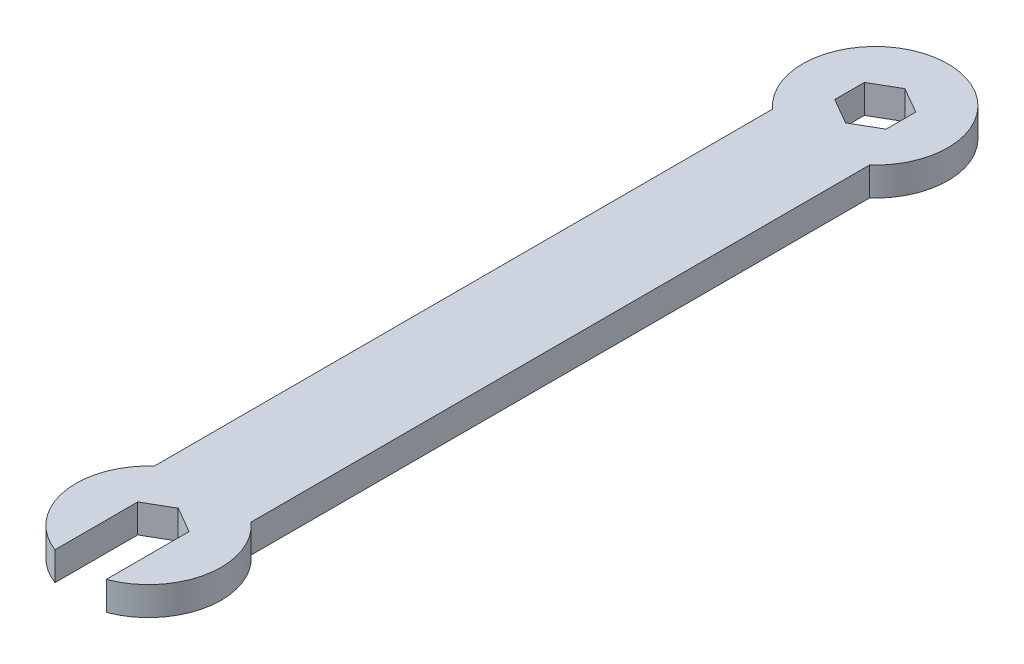
ISO-10303-21;
HEADER;
FILE_DESCRIPTION(('STEP AP214'),'2;1');
FILE_NAME('part.step','',(''),(''),'','','');
FILE_SCHEMA(('AUTOMOTIVE_DESIGN { 1 0 10303 214 1 1 1 1 }'));
ENDSEC;
DATA;
#1=APPLICATION_CONTEXT('core data for automotive mechanical design processes');
#2=APPLICATION_PROTOCOL_DEFINITION('international standard','automotive_design',2000,#1);
#3=PRODUCT_CONTEXT('',#1,'mechanical');
#4=PRODUCT('Part','Part','',(#3));
#5=PRODUCT_RELATED_PRODUCT_CATEGORY('part','',(#4));
#6=PRODUCT_DEFINITION_FORMATION('','',#4);
#7=PRODUCT_DEFINITION_CONTEXT('part definition',#1,'design');
#8=PRODUCT_DEFINITION('design','',#6,#7);
#9=PRODUCT_DEFINITION_SHAPE('','',#8);
#10=(LENGTH_UNIT() NAMED_UNIT(*) SI_UNIT(.MILLI.,.METRE.));
#11=(NAMED_UNIT(*) PLANE_ANGLE_UNIT() SI_UNIT($,.RADIAN.));
#12=(NAMED_UNIT(*) SI_UNIT($,.STERADIAN.) SOLID_ANGLE_UNIT());
#13=UNCERTAINTY_MEASURE_WITH_UNIT(LENGTH_MEASURE(1.E-05),#10,'distance_accuracy_value','');
#14=(GEOMETRIC_REPRESENTATION_CONTEXT(3) GLOBAL_UNCERTAINTY_ASSIGNED_CONTEXT((#13)) GLOBAL_UNIT_ASSIGNED_CONTEXT((#10,
#11,#12)) REPRESENTATION_CONTEXT('',''));
#15=CARTESIAN_POINT('',(0.,0.,0.));
#16=DIRECTION('',(0.,0.,1.));
#17=DIRECTION('',(1.,0.,0.));
#18=AXIS2_PLACEMENT_3D('',#15,#16,#17);
#19=CARTESIAN_POINT('',(1.325,2.95,-2.29496732002876));
#20=DIRECTION('',(-0.5,0.,0.866025403784439));
#21=DIRECTION('',(0.866025403784439,0.,0.5));
#22=AXIS2_PLACEMENT_3D('',#19,#20,#21);
#23=PLANE('',#22);
#24=DIRECTION('',(-0.866025403784439,0.,-0.5));
#25=VECTOR('',#24,1.);
#26=CARTESIAN_POINT('',(1.325,0.,-2.29496732002876));
#27=LINE('',#26,#25);
#28=CARTESIAN_POINT('',(2.65,0.,-1.52997821335251));
#29=VERTEX_POINT('',#28);
#30=CARTESIAN_POINT('',(0.,0.,-3.05995642670502));
#31=VERTEX_POINT('',#30);
#32=EDGE_CURVE('E205',#29,#31,#27,.T.);
#33=ORIENTED_EDGE('',*,*,#32,.F.);
#34=DIRECTION('',(0.,-1.,0.));
#35=VECTOR('',#34,1.);
#36=CARTESIAN_POINT('',(2.65,2.95,-1.52997821335251));
#37=LINE('',#36,#35);
#38=CARTESIAN_POINT('',(2.65,2.95,-1.52997821335251));
#39=VERTEX_POINT('',#38);
#40=EDGE_CURVE('E11',#39,#29,#37,.T.);
#41=ORIENTED_EDGE('',*,*,#40,.F.);
#42=DIRECTION('',(-0.866025403784439,0.,-0.5));
#43=VECTOR('',#42,1.);
#44=CARTESIAN_POINT('',(1.325,2.95,-2.29496732002876));
#45=LINE('',#44,#43);
#46=CARTESIAN_POINT('',(0.,2.95,-3.05995642670502));
#47=VERTEX_POINT('',#46);
#48=EDGE_CURVE('E457',#39,#47,#45,.T.);
#49=ORIENTED_EDGE('',*,*,#48,.T.);
#50=DIRECTION('',(0.,-1.,0.));
#51=VECTOR('',#50,1.);
#52=CARTESIAN_POINT('',(0.,2.95,-3.05995642670502));
#53=LINE('',#52,#51);
#54=EDGE_CURVE('E54',#47,#31,#53,.T.);
#55=ORIENTED_EDGE('',*,*,#54,.T.);
#56=EDGE_LOOP('',(#33,#41,#49,#55));
#57=FACE_BOUND('',#56,.T.);
#58=ADVANCED_FACE('F35',(#57),#23,.T.);
#59=CARTESIAN_POINT('',(2.65,2.95,0.));
#60=DIRECTION('',(-1.,0.,0.));
#61=DIRECTION('',(0.,0.,1.));
#62=AXIS2_PLACEMENT_3D('',#59,#60,#61);
#63=PLANE('',#62);
#64=DIRECTION('',(0.,0.,-1.));
#65=VECTOR('',#64,1.);
#66=CARTESIAN_POINT('',(2.65,0.,0.));
#67=LINE('',#66,#65);
#68=CARTESIAN_POINT('',(2.65,0.,1.52997821335251));
#69=VERTEX_POINT('',#68);
#70=EDGE_CURVE('E207',#69,#29,#67,.T.);
#71=ORIENTED_EDGE('',*,*,#70,.F.);
#72=DIRECTION('',(0.,-1.,0.));
#73=VECTOR('',#72,1.);
#74=CARTESIAN_POINT('',(2.65,2.95,1.52997821335251));
#75=LINE('',#74,#73);
#76=CARTESIAN_POINT('',(2.65,2.95,1.52997821335251));
#77=VERTEX_POINT('',#76);
#78=EDGE_CURVE('E45',#77,#69,#75,.T.);
#79=ORIENTED_EDGE('',*,*,#78,.F.);
#80=DIRECTION('',(0.,0.,-1.));
#81=VECTOR('',#80,1.);
#82=CARTESIAN_POINT('',(2.65,2.95,0.));
#83=LINE('',#82,#81);
#84=EDGE_CURVE('E459',#77,#39,#83,.T.);
#85=ORIENTED_EDGE('',*,*,#84,.T.);
#86=ORIENTED_EDGE('',*,*,#40,.T.);
#87=EDGE_LOOP('',(#71,#79,#85,#86));
#88=FACE_BOUND('',#87,.T.);
#89=ADVANCED_FACE('F293',(#88),#63,.T.);
#90=CARTESIAN_POINT('',(1.325,2.95,2.29496732002876));
#91=DIRECTION('',(-0.5,0.,-0.866025403784438));
#92=DIRECTION('',(-0.866025403784439,0.,0.5));
#93=AXIS2_PLACEMENT_3D('',#90,#91,#92);
#94=PLANE('',#93);
#95=DIRECTION('',(0.866025403784439,0.,-0.5));
#96=VECTOR('',#95,1.);
#97=CARTESIAN_POINT('',(1.325,0.,2.29496732002876));
#98=LINE('',#97,#96);
#99=CARTESIAN_POINT('',(0.,0.,3.05995642670502));
#100=VERTEX_POINT('',#99);
#101=EDGE_CURVE('E210',#100,#69,#98,.T.);
#102=ORIENTED_EDGE('',*,*,#101,.F.);
#103=DIRECTION('',(0.,-1.,0.));
#104=VECTOR('',#103,1.);
#105=CARTESIAN_POINT('',(0.,2.95,3.05995642670502));
#106=LINE('',#105,#104);
#107=CARTESIAN_POINT('',(0.,2.95,3.05995642670502));
#108=VERTEX_POINT('',#107);
#109=EDGE_CURVE('E159',#108,#100,#106,.T.);
#110=ORIENTED_EDGE('',*,*,#109,.F.);
#111=DIRECTION('',(0.866025403784439,0.,-0.5));
#112=VECTOR('',#111,1.);
#113=CARTESIAN_POINT('',(1.325,2.95,2.29496732002876));
#114=LINE('',#113,#112);
#115=EDGE_CURVE('E170',#108,#77,#114,.T.);
#116=ORIENTED_EDGE('',*,*,#115,.T.);
#117=ORIENTED_EDGE('',*,*,#78,.T.);
#118=EDGE_LOOP('',(#102,#110,#116,#117));
#119=FACE_BOUND('',#118,.T.);
#120=ADVANCED_FACE('F298',(#119),#94,.T.);
#121=CARTESIAN_POINT('',(-1.325,2.95,2.29496732002876));
#122=DIRECTION('',(0.5,0.,-0.866025403784438));
#123=DIRECTION('',(-0.866025403784439,0.,-0.5));
#124=AXIS2_PLACEMENT_3D('',#121,#122,#123);
#125=PLANE('',#124);
#126=DIRECTION('',(0.866025403784439,0.,0.5));
#127=VECTOR('',#126,1.);
#128=CARTESIAN_POINT('',(-1.325,0.,2.29496732002876));
#129=LINE('',#128,#127);
#130=CARTESIAN_POINT('',(-2.65,0.,1.52997821335251));
#131=VERTEX_POINT('',#130);
#132=EDGE_CURVE('E155',#131,#100,#129,.T.);
#133=ORIENTED_EDGE('',*,*,#132,.F.);
#134=DIRECTION('',(0.,-1.,0.));
#135=VECTOR('',#134,1.);
#136=CARTESIAN_POINT('',(-2.65,2.95,1.52997821335251));
#137=LINE('',#136,#135);
#138=CARTESIAN_POINT('',(-2.65,2.95,1.52997821335251));
#139=VERTEX_POINT('',#138);
#140=EDGE_CURVE('E150',#139,#131,#137,.T.);
#141=ORIENTED_EDGE('',*,*,#140,.F.);
#142=DIRECTION('',(0.866025403784439,0.,0.5));
#143=VECTOR('',#142,1.);
#144=CARTESIAN_POINT('',(-1.325,2.95,2.29496732002876));
#145=LINE('',#144,#143);
#146=EDGE_CURVE('E153',#139,#108,#145,.T.);
#147=ORIENTED_EDGE('',*,*,#146,.T.);
#148=ORIENTED_EDGE('',*,*,#109,.T.);
#149=EDGE_LOOP('',(#133,#141,#147,#148));
#150=FACE_BOUND('',#149,.T.);
#151=ADVANCED_FACE('F152',(#150),#125,.T.);
#152=CARTESIAN_POINT('',(-2.65,2.95,0.));
#153=DIRECTION('',(1.,0.,0.));
#154=DIRECTION('',(0.,0.,-1.));
#155=AXIS2_PLACEMENT_3D('',#152,#153,#154);
#156=PLANE('',#155);
#157=DIRECTION('',(0.,0.,1.));
#158=VECTOR('',#157,1.);
#159=CARTESIAN_POINT('',(-2.65,0.,0.));
#160=LINE('',#159,#158);
#161=CARTESIAN_POINT('',(-2.65,0.,-1.52997821335251));
#162=VERTEX_POINT('',#161);
#163=EDGE_CURVE('E214',#162,#131,#160,.T.);
#164=ORIENTED_EDGE('',*,*,#163,.F.);
#165=DIRECTION('',(0.,-1.,0.));
#166=VECTOR('',#165,1.);
#167=CARTESIAN_POINT('',(-2.65,2.95,-1.52997821335251));
#168=LINE('',#167,#166);
#169=CARTESIAN_POINT('',(-2.65,2.95,-1.52997821335251));
#170=VERTEX_POINT('',#169);
#171=EDGE_CURVE('E100',#170,#162,#168,.T.);
#172=ORIENTED_EDGE('',*,*,#171,.F.);
#173=DIRECTION('',(0.,0.,1.));
#174=VECTOR('',#173,1.);
#175=CARTESIAN_POINT('',(-2.65,2.95,0.));
#176=LINE('',#175,#174);
#177=EDGE_CURVE('E167',#170,#139,#176,.T.);
#178=ORIENTED_EDGE('',*,*,#177,.T.);
#179=ORIENTED_EDGE('',*,*,#140,.T.);
#180=EDGE_LOOP('',(#164,#172,#178,#179));
#181=FACE_BOUND('',#180,.T.);
#182=ADVANCED_FACE('F172',(#181),#156,.T.);
#183=CARTESIAN_POINT('',(0.,2.95,0.));
#184=DIRECTION('',(0.,-1.,0.));
#185=DIRECTION('',(0.,0.,-1.));
#186=AXIS2_PLACEMENT_3D('',#183,#184,#185);
#187=CYLINDRICAL_SURFACE('',#186,7.5);
#188=CARTESIAN_POINT('',(0.,0.,0.));
#189=DIRECTION('',(0.,1.,0.));
#190=DIRECTION('',(0.,0.,1.));
#191=AXIS2_PLACEMENT_3D('',#188,#189,#190);
#192=CIRCLE('',#191,7.5);
#193=CARTESIAN_POINT('',(5.,0.,5.59016994374947));
#194=VERTEX_POINT('',#193);
#195=CARTESIAN_POINT('',(-5.,0.,5.59016994374947));
#196=VERTEX_POINT('',#195);
#197=EDGE_CURVE('E179',#194,#196,#192,.T.);
#198=ORIENTED_EDGE('',*,*,#197,.T.);
#199=DIRECTION('',(0.,-1.,0.));
#200=VECTOR('',#199,1.);
#201=CARTESIAN_POINT('',(-5.,2.95,5.59016994374947));
#202=LINE('',#201,#200);
#203=CARTESIAN_POINT('',(-5.,2.95,5.59016994374947));
#204=VERTEX_POINT('',#203);
#205=EDGE_CURVE('E39',#204,#196,#202,.T.);
#206=ORIENTED_EDGE('',*,*,#205,.F.);
#207=CARTESIAN_POINT('',(0.,2.95,0.));
#208=DIRECTION('',(0.,1.,0.));
#209=DIRECTION('',(0.,0.,1.));
#210=AXIS2_PLACEMENT_3D('',#207,#208,#209);
#211=CIRCLE('',#210,7.5);
#212=CARTESIAN_POINT('',(5.,2.95,5.59016994374947));
#213=VERTEX_POINT('',#212);
#214=EDGE_CURVE('E219',#213,#204,#211,.T.);
#215=ORIENTED_EDGE('',*,*,#214,.F.);
#216=DIRECTION('',(0.,-1.,0.));
#217=VECTOR('',#216,1.);
#218=CARTESIAN_POINT('',(5.,2.95,5.59016994374947));
#219=LINE('',#218,#217);
#220=EDGE_CURVE('E175',#213,#194,#219,.T.);
#221=ORIENTED_EDGE('',*,*,#220,.T.);
#222=EDGE_LOOP('',(#198,#206,#215,#221));
#223=FACE_BOUND('',#222,.T.);
#224=ADVANCED_FACE('F37',(#223),#187,.T.);
#225=CARTESIAN_POINT('',(-5.,2.95,0.));
#226=DIRECTION('',(1.,0.,0.));
#227=DIRECTION('',(0.,0.,-1.));
#228=AXIS2_PLACEMENT_3D('',#225,#226,#227);
#229=PLANE('',#228);
#230=DIRECTION('',(0.,0.,1.));
#231=VECTOR('',#230,1.);
#232=CARTESIAN_POINT('',(-5.,0.,0.));
#233=LINE('',#232,#231);
#234=CARTESIAN_POINT('',(-5.00000000000001,0.,69.4098300562505));
#235=VERTEX_POINT('',#234);
#236=EDGE_CURVE('E182',#196,#235,#233,.T.);
#237=ORIENTED_EDGE('',*,*,#236,.T.);
#238=DIRECTION('',(0.,-1.,0.));
#239=VECTOR('',#238,1.);
#240=CARTESIAN_POINT('',(-5.00000000000001,2.95,69.4098300562505));
#241=LINE('',#240,#239);
#242=CARTESIAN_POINT('',(-5.00000000000001,2.95,69.4098300562505));
#243=VERTEX_POINT('',#242);
#244=EDGE_CURVE('E236',#243,#235,#241,.T.);
#245=ORIENTED_EDGE('',*,*,#244,.F.);
#246=DIRECTION('',(0.,0.,1.));
#247=VECTOR('',#246,1.);
#248=CARTESIAN_POINT('',(-5.,2.95,0.));
#249=LINE('',#248,#247);
#250=EDGE_CURVE('E113',#204,#243,#249,.T.);
#251=ORIENTED_EDGE('',*,*,#250,.F.);
#252=ORIENTED_EDGE('',*,*,#205,.T.);
#253=EDGE_LOOP('',(#237,#245,#251,#252));
#254=FACE_BOUND('',#253,.T.);
#255=ADVANCED_FACE('F242',(#254),#229,.F.);
#256=CARTESIAN_POINT('',(0.,2.95,75.));
#257=DIRECTION('',(0.,-1.,0.));
#258=DIRECTION('',(0.,0.,-1.));
#259=AXIS2_PLACEMENT_3D('',#256,#257,#258);
#260=CYLINDRICAL_SURFACE('',#259,7.5);
#261=CARTESIAN_POINT('',(0.,0.,75.));
#262=DIRECTION('',(0.,1.,0.));
#263=DIRECTION('',(0.,0.,1.));
#264=AXIS2_PLACEMENT_3D('',#261,#262,#263);
#265=CIRCLE('',#264,7.5);
#266=CARTESIAN_POINT('',(-2.65,0.,82.0162311820521));
#267=VERTEX_POINT('',#266);
#268=EDGE_CURVE('E184',#235,#267,#265,.T.);
#269=ORIENTED_EDGE('',*,*,#268,.T.);
#270=DIRECTION('',(0.,-1.,0.));
#271=VECTOR('',#270,1.);
#272=CARTESIAN_POINT('',(-2.65,2.95,82.0162311820521));
#273=LINE('',#272,#271);
#274=CARTESIAN_POINT('',(-2.65,2.95,82.0162311820521));
#275=VERTEX_POINT('',#274);
#276=EDGE_CURVE('E235',#275,#267,#273,.T.);
#277=ORIENTED_EDGE('',*,*,#276,.F.);
#278=CARTESIAN_POINT('',(0.,2.95,75.));
#279=DIRECTION('',(0.,1.,0.));
#280=DIRECTION('',(0.,0.,1.));
#281=AXIS2_PLACEMENT_3D('',#278,#279,#280);
#282=CIRCLE('',#281,7.5);
#283=EDGE_CURVE('E471',#243,#275,#282,.T.);
#284=ORIENTED_EDGE('',*,*,#283,.F.);
#285=ORIENTED_EDGE('',*,*,#244,.T.);
#286=EDGE_LOOP('',(#269,#277,#284,#285));
#287=FACE_BOUND('',#286,.T.);
#288=ADVANCED_FACE('F284',(#287),#260,.T.);
#289=CARTESIAN_POINT('',(-2.65,2.95,0.));
#290=DIRECTION('',(1.,0.,0.));
#291=DIRECTION('',(0.,0.,-1.));
#292=AXIS2_PLACEMENT_3D('',#289,#290,#291);
#293=PLANE('',#292);
#294=DIRECTION('',(0.,0.,1.));
#295=VECTOR('',#294,1.);
#296=CARTESIAN_POINT('',(-2.65,0.,0.));
#297=LINE('',#296,#295);
#298=CARTESIAN_POINT('',(-2.65,0.,73.4700217866475));
#299=VERTEX_POINT('',#298);
#300=EDGE_CURVE('E187',#299,#267,#297,.T.);
#301=ORIENTED_EDGE('',*,*,#300,.F.);
#302=DIRECTION('',(0.,-1.,0.));
#303=VECTOR('',#302,1.);
#304=CARTESIAN_POINT('',(-2.65,2.95,73.4700217866475));
#305=LINE('',#304,#303);
#306=CARTESIAN_POINT('',(-2.65,2.95,73.4700217866475));
#307=VERTEX_POINT('',#306);
#308=EDGE_CURVE('E233',#307,#299,#305,.T.);
#309=ORIENTED_EDGE('',*,*,#308,.F.);
#310=DIRECTION('',(0.,0.,1.));
#311=VECTOR('',#310,1.);
#312=CARTESIAN_POINT('',(-2.65,2.95,0.));
#313=LINE('',#312,#311);
#314=EDGE_CURVE('E283',#307,#275,#313,.T.);
#315=ORIENTED_EDGE('',*,*,#314,.T.);
#316=ORIENTED_EDGE('',*,*,#276,.T.);
#317=EDGE_LOOP('',(#301,#309,#315,#316));
#318=FACE_BOUND('',#317,.T.);
#319=ADVANCED_FACE('F281',(#318),#293,.T.);
#320=CARTESIAN_POINT('',(31.1509526419164,2.95,53.9550326799712));
#321=DIRECTION('',(0.5,0.,0.866025403784439));
#322=DIRECTION('',(0.866025403784439,0.,-0.5));
#323=AXIS2_PLACEMENT_3D('',#320,#321,#322);
#324=PLANE('',#323);
#325=DIRECTION('',(-0.866025403784439,0.,0.5));
#326=VECTOR('',#325,1.);
#327=CARTESIAN_POINT('',(31.1509526419164,0.,53.9550326799712));
#328=LINE('',#327,#326);
#329=CARTESIAN_POINT('',(0.,0.,71.940043573295));
#330=VERTEX_POINT('',#329);
#331=EDGE_CURVE('E190',#330,#299,#328,.T.);
#332=ORIENTED_EDGE('',*,*,#331,.F.);
#333=DIRECTION('',(0.,-1.,0.));
#334=VECTOR('',#333,1.);
#335=CARTESIAN_POINT('',(0.,2.95,71.940043573295));
#336=LINE('',#335,#334);
#337=CARTESIAN_POINT('',(0.,2.95,71.940043573295));
#338=VERTEX_POINT('',#337);
#339=EDGE_CURVE('E231',#338,#330,#336,.T.);
#340=ORIENTED_EDGE('',*,*,#339,.F.);
#341=DIRECTION('',(-0.866025403784439,0.,0.5));
#342=VECTOR('',#341,1.);
#343=CARTESIAN_POINT('',(31.1509526419164,2.95,53.9550326799712));
#344=LINE('',#343,#342);
#345=EDGE_CURVE('E277',#338,#307,#344,.T.);
#346=ORIENTED_EDGE('',*,*,#345,.T.);
#347=ORIENTED_EDGE('',*,*,#308,.T.);
#348=EDGE_LOOP('',(#332,#340,#346,#347));
#349=FACE_BOUND('',#348,.T.);
#350=ADVANCED_FACE('F274',(#349),#324,.T.);
#351=CARTESIAN_POINT('',(-31.1509526419166,2.95,53.955032679971));
#352=DIRECTION('',(-0.500000000000003,0.,0.866025403784437));
#353=DIRECTION('',(0.866025403784437,0.,0.500000000000003));
#354=AXIS2_PLACEMENT_3D('',#351,#352,#353);
#355=PLANE('',#354);
#356=DIRECTION('',(-0.866025403784437,0.,-0.500000000000003));
#357=VECTOR('',#356,1.);
#358=CARTESIAN_POINT('',(-31.1509526419166,0.,53.955032679971));
#359=LINE('',#358,#357);
#360=CARTESIAN_POINT('',(2.64999999999999,0.,73.4700217866475));
#361=VERTEX_POINT('',#360);
#362=EDGE_CURVE('E193',#361,#330,#359,.T.);
#363=ORIENTED_EDGE('',*,*,#362,.F.);
#364=DIRECTION('',(0.,-1.,0.));
#365=VECTOR('',#364,1.);
#366=CARTESIAN_POINT('',(2.64999999999999,2.95,73.4700217866475));
#367=LINE('',#366,#365);
#368=CARTESIAN_POINT('',(2.64999999999999,2.95,73.4700217866475));
#369=VERTEX_POINT('',#368);
#370=EDGE_CURVE('E229',#369,#361,#367,.T.);
#371=ORIENTED_EDGE('',*,*,#370,.F.);
#372=DIRECTION('',(-0.866025403784437,0.,-0.500000000000003));
#373=VECTOR('',#372,1.);
#374=CARTESIAN_POINT('',(-31.1509526419166,2.95,53.955032679971));
#375=LINE('',#374,#373);
#376=EDGE_CURVE('E467',#369,#338,#375,.T.);
#377=ORIENTED_EDGE('',*,*,#376,.T.);
#378=ORIENTED_EDGE('',*,*,#339,.T.);
#379=EDGE_LOOP('',(#363,#371,#377,#378));
#380=FACE_BOUND('',#379,.T.);
#381=ADVANCED_FACE('F270',(#380),#355,.T.);
#382=CARTESIAN_POINT('',(2.64999999999995,2.95,0.));
#383=DIRECTION('',(-1.,0.,0.));
#384=DIRECTION('',(0.,0.,1.));
#385=AXIS2_PLACEMENT_3D('',#382,#383,#384);
#386=PLANE('',#385);
#387=DIRECTION('',(0.,0.,-1.));
#388=VECTOR('',#387,1.);
#389=CARTESIAN_POINT('',(2.64999999999995,0.,0.));
#390=LINE('',#389,#388);
#391=CARTESIAN_POINT('',(2.65,0.,82.0162311820521));
#392=VERTEX_POINT('',#391);
#393=EDGE_CURVE('E196',#392,#361,#390,.T.);
#394=ORIENTED_EDGE('',*,*,#393,.F.);
#395=DIRECTION('',(0.,-1.,0.));
#396=VECTOR('',#395,1.);
#397=CARTESIAN_POINT('',(2.65,2.95,82.0162311820521));
#398=LINE('',#397,#396);
#399=CARTESIAN_POINT('',(2.65,2.95,82.0162311820521));
#400=VERTEX_POINT('',#399);
#401=EDGE_CURVE('E227',#400,#392,#398,.T.);
#402=ORIENTED_EDGE('',*,*,#401,.F.);
#403=DIRECTION('',(0.,0.,-1.));
#404=VECTOR('',#403,1.);
#405=CARTESIAN_POINT('',(2.64999999999995,2.95,0.));
#406=LINE('',#405,#404);
#407=EDGE_CURVE('E266',#400,#369,#406,.T.);
#408=ORIENTED_EDGE('',*,*,#407,.T.);
#409=ORIENTED_EDGE('',*,*,#370,.T.);
#410=EDGE_LOOP('',(#394,#402,#408,#409));
#411=FACE_BOUND('',#410,.T.);
#412=ADVANCED_FACE('F262',(#411),#386,.T.);
#413=CARTESIAN_POINT('',(0.,2.95,75.));
#414=DIRECTION('',(0.,-1.,0.));
#415=DIRECTION('',(0.,0.,-1.));
#416=AXIS2_PLACEMENT_3D('',#413,#414,#415);
#417=CYLINDRICAL_SURFACE('',#416,7.5);
#418=CARTESIAN_POINT('',(0.,0.,75.));
#419=DIRECTION('',(0.,1.,0.));
#420=DIRECTION('',(0.,0.,1.));
#421=AXIS2_PLACEMENT_3D('',#418,#419,#420);
#422=CIRCLE('',#421,7.5);
#423=CARTESIAN_POINT('',(5.00000000000001,0.,69.4098300562505));
#424=VERTEX_POINT('',#423);
#425=EDGE_CURVE('E199',#392,#424,#422,.T.);
#426=ORIENTED_EDGE('',*,*,#425,.T.);
#427=DIRECTION('',(0.,-1.,0.));
#428=VECTOR('',#427,1.);
#429=CARTESIAN_POINT('',(5.00000000000001,2.95,69.4098300562505));
#430=LINE('',#429,#428);
#431=CARTESIAN_POINT('',(5.00000000000001,2.95,69.4098300562505));
#432=VERTEX_POINT('',#431);
#433=EDGE_CURVE('E225',#432,#424,#430,.T.);
#434=ORIENTED_EDGE('',*,*,#433,.F.);
#435=CARTESIAN_POINT('',(0.,2.95,75.));
#436=DIRECTION('',(0.,1.,0.));
#437=DIRECTION('',(0.,0.,1.));
#438=AXIS2_PLACEMENT_3D('',#435,#436,#437);
#439=CIRCLE('',#438,7.5);
#440=EDGE_CURVE('E464',#400,#432,#439,.T.);
#441=ORIENTED_EDGE('',*,*,#440,.F.);
#442=ORIENTED_EDGE('',*,*,#401,.T.);
#443=EDGE_LOOP('',(#426,#434,#441,#442));
#444=FACE_BOUND('',#443,.T.);
#445=ADVANCED_FACE('F259',(#444),#417,.T.);
#446=CARTESIAN_POINT('',(5.,2.95,0.));
#447=DIRECTION('',(1.,0.,0.));
#448=DIRECTION('',(0.,0.,-1.));
#449=AXIS2_PLACEMENT_3D('',#446,#447,#448);
#450=PLANE('',#449);
#451=DIRECTION('',(0.,0.,1.));
#452=VECTOR('',#451,1.);
#453=CARTESIAN_POINT('',(5.,0.,0.));
#454=LINE('',#453,#452);
#455=EDGE_CURVE('E202',#194,#424,#454,.T.);
#456=ORIENTED_EDGE('',*,*,#455,.F.);
#457=ORIENTED_EDGE('',*,*,#220,.F.);
#458=DIRECTION('',(0.,0.,1.));
#459=VECTOR('',#458,1.);
#460=CARTESIAN_POINT('',(5.,2.95,0.));
#461=LINE('',#460,#459);
#462=EDGE_CURVE('E256',#213,#432,#461,.T.);
#463=ORIENTED_EDGE('',*,*,#462,.T.);
#464=ORIENTED_EDGE('',*,*,#433,.T.);
#465=EDGE_LOOP('',(#456,#457,#463,#464));
#466=FACE_BOUND('',#465,.T.);
#467=ADVANCED_FACE('F252',(#466),#450,.T.);
#468=CARTESIAN_POINT('',(-1.325,2.95,-2.29496732002876));
#469=DIRECTION('',(0.5,0.,0.866025403784439));
#470=DIRECTION('',(0.866025403784439,0.,-0.5));
#471=AXIS2_PLACEMENT_3D('',#468,#469,#470);
#472=PLANE('',#471);
#473=DIRECTION('',(-0.866025403784439,0.,0.5));
#474=VECTOR('',#473,1.);
#475=CARTESIAN_POINT('',(-1.325,0.,-2.29496732002876));
#476=LINE('',#475,#474);
#477=EDGE_CURVE('E216',#31,#162,#476,.T.);
#478=ORIENTED_EDGE('',*,*,#477,.F.);
#479=ORIENTED_EDGE('',*,*,#54,.F.);
#480=DIRECTION('',(-0.866025403784439,0.,0.5));
#481=VECTOR('',#480,1.);
#482=CARTESIAN_POINT('',(-1.325,2.95,-2.29496732002876));
#483=LINE('',#482,#481);
#484=EDGE_CURVE('E173',#47,#170,#483,.T.);
#485=ORIENTED_EDGE('',*,*,#484,.T.);
#486=ORIENTED_EDGE('',*,*,#171,.T.);
#487=EDGE_LOOP('',(#478,#479,#485,#486));
#488=FACE_BOUND('',#487,.T.);
#489=ADVANCED_FACE('F305',(#488),#472,.T.);
#490=CARTESIAN_POINT('',(0.,2.95,0.));
#491=DIRECTION('',(0.,1.,0.));
#492=DIRECTION('',(0.,0.,1.));
#493=AXIS2_PLACEMENT_3D('',#490,#491,#492);
#494=PLANE('',#493);
#495=ORIENTED_EDGE('',*,*,#214,.T.);
#496=ORIENTED_EDGE('',*,*,#250,.T.);
#497=ORIENTED_EDGE('',*,*,#283,.T.);
#498=ORIENTED_EDGE('',*,*,#314,.F.);
#499=ORIENTED_EDGE('',*,*,#345,.F.);
#500=ORIENTED_EDGE('',*,*,#376,.F.);
#501=ORIENTED_EDGE('',*,*,#407,.F.);
#502=ORIENTED_EDGE('',*,*,#440,.T.);
#503=ORIENTED_EDGE('',*,*,#462,.F.);
#504=EDGE_LOOP('',(#495,#496,#497,#498,#499,#500,#501,#502,#503));
#505=FACE_BOUND('',#504,.T.);
#506=ORIENTED_EDGE('',*,*,#48,.F.);
#507=ORIENTED_EDGE('',*,*,#84,.F.);
#508=ORIENTED_EDGE('',*,*,#115,.F.);
#509=ORIENTED_EDGE('',*,*,#146,.F.);
#510=ORIENTED_EDGE('',*,*,#177,.F.);
#511=ORIENTED_EDGE('',*,*,#484,.F.);
#512=EDGE_LOOP('',(#506,#507,#508,#509,#510,#511));
#513=FACE_BOUND('',#512,.T.);
#514=ADVANCED_FACE('F165',(#505,#513),#494,.T.);
#515=CARTESIAN_POINT('',(0.,0.,0.));
#516=DIRECTION('',(0.,1.,0.));
#517=DIRECTION('',(0.,0.,1.));
#518=AXIS2_PLACEMENT_3D('',#515,#516,#517);
#519=PLANE('',#518);
#520=ORIENTED_EDGE('',*,*,#197,.F.);
#521=ORIENTED_EDGE('',*,*,#455,.T.);
#522=ORIENTED_EDGE('',*,*,#425,.F.);
#523=ORIENTED_EDGE('',*,*,#393,.T.);
#524=ORIENTED_EDGE('',*,*,#362,.T.);
#525=ORIENTED_EDGE('',*,*,#331,.T.);
#526=ORIENTED_EDGE('',*,*,#300,.T.);
#527=ORIENTED_EDGE('',*,*,#268,.F.);
#528=ORIENTED_EDGE('',*,*,#236,.F.);
#529=EDGE_LOOP('',(#520,#521,#522,#523,#524,#525,#526,#527,#528));
#530=FACE_BOUND('',#529,.T.);
#531=ORIENTED_EDGE('',*,*,#32,.T.);
#532=ORIENTED_EDGE('',*,*,#477,.T.);
#533=ORIENTED_EDGE('',*,*,#163,.T.);
#534=ORIENTED_EDGE('',*,*,#132,.T.);
#535=ORIENTED_EDGE('',*,*,#101,.T.);
#536=ORIENTED_EDGE('',*,*,#70,.T.);
#537=EDGE_LOOP('',(#531,#532,#533,#534,#535,#536));
#538=FACE_BOUND('',#537,.T.);
#539=ADVANCED_FACE('F248',(#530,#538),#519,.F.);
#540=CLOSED_SHELL('',(#58,#89,#120,#151,#182,#224,#255,#288,#319,#350,#381,#412,#445,#467,#489,
#514,#539));
#541=MANIFOLD_SOLID_BREP('B2',#540);
#542=ADVANCED_BREP_SHAPE_REPRESENTATION('',(#18,#541),#14);
#543=SHAPE_DEFINITION_REPRESENTATION(#9,#542);
ENDSEC;
END-ISO-10303-21;
